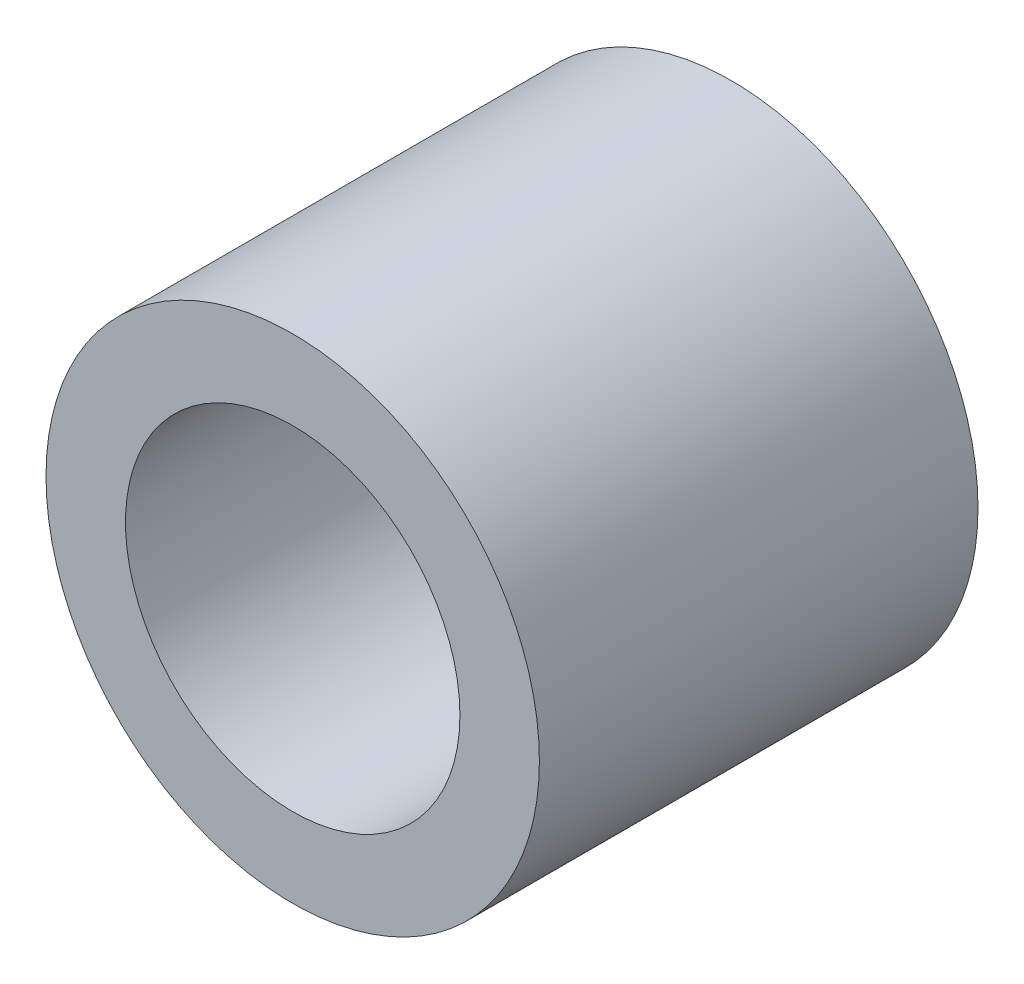
ISO-10303-21;
HEADER;
FILE_DESCRIPTION(('STEP AP214'),'2;1');
FILE_NAME('part.step','',(''),(''),'','','');
FILE_SCHEMA(('AUTOMOTIVE_DESIGN { 1 0 10303 214 1 1 1 1 }'));
ENDSEC;
DATA;
#1=APPLICATION_CONTEXT('core data for automotive mechanical design processes');
#2=APPLICATION_PROTOCOL_DEFINITION('international standard','automotive_design',2000,#1);
#3=PRODUCT_CONTEXT('',#1,'mechanical');
#4=PRODUCT('Part','Part','',(#3));
#5=PRODUCT_RELATED_PRODUCT_CATEGORY('part','',(#4));
#6=PRODUCT_DEFINITION_FORMATION('','',#4);
#7=PRODUCT_DEFINITION_CONTEXT('part definition',#1,'design');
#8=PRODUCT_DEFINITION('design','',#6,#7);
#9=PRODUCT_DEFINITION_SHAPE('','',#8);
#10=(LENGTH_UNIT() NAMED_UNIT(*) SI_UNIT(.MILLI.,.METRE.));
#11=(NAMED_UNIT(*) PLANE_ANGLE_UNIT() SI_UNIT($,.RADIAN.));
#12=(NAMED_UNIT(*) SI_UNIT($,.STERADIAN.) SOLID_ANGLE_UNIT());
#13=UNCERTAINTY_MEASURE_WITH_UNIT(LENGTH_MEASURE(1.E-05),#10,'distance_accuracy_value','');
#14=(GEOMETRIC_REPRESENTATION_CONTEXT(3) GLOBAL_UNCERTAINTY_ASSIGNED_CONTEXT((#13)) GLOBAL_UNIT_ASSIGNED_CONTEXT((#10,
#11,#12)) REPRESENTATION_CONTEXT('',''));
#15=CARTESIAN_POINT('',(0.,0.,0.));
#16=DIRECTION('',(0.,0.,1.));
#17=DIRECTION('',(1.,0.,0.));
#18=AXIS2_PLACEMENT_3D('',#15,#16,#17);
#19=CARTESIAN_POINT('',(0.,0.,1.5));
#20=DIRECTION('',(0.,0.,-1.));
#21=DIRECTION('',(-1.,0.,0.));
#22=AXIS2_PLACEMENT_3D('',#19,#20,#21);
#23=CYLINDRICAL_SURFACE('',#22,2.25);
#24=CARTESIAN_POINT('',(0.,0.,0.));
#25=DIRECTION('',(0.,0.,1.));
#26=DIRECTION('',(1.,0.,0.));
#27=AXIS2_PLACEMENT_3D('',#24,#25,#26);
#28=CIRCLE('',#27,2.25);
#29=CARTESIAN_POINT('',(2.25,0.,0.));
#30=VERTEX_POINT('',#29);
#31=EDGE_CURVE('E10',#30,#30,#28,.T.);
#32=ORIENTED_EDGE('',*,*,#31,.T.);
#33=EDGE_LOOP('',(#32));
#34=FACE_BOUND('',#33,.T.);
#35=CARTESIAN_POINT('',(0.,0.,4.));
#36=DIRECTION('',(0.,0.,1.));
#37=DIRECTION('',(1.,0.,0.));
#38=AXIS2_PLACEMENT_3D('',#35,#36,#37);
#39=CIRCLE('',#38,2.25);
#40=CARTESIAN_POINT('',(2.25,0.,4.));
#41=VERTEX_POINT('',#40);
#42=EDGE_CURVE('E38',#41,#41,#39,.T.);
#43=ORIENTED_EDGE('',*,*,#42,.F.);
#44=EDGE_LOOP('',(#43));
#45=FACE_BOUND('',#44,.T.);
#46=ADVANCED_FACE('F32',(#34,#45),#23,.T.);
#47=CARTESIAN_POINT('',(0.,0.,0.));
#48=DIRECTION('',(0.,0.,1.));
#49=DIRECTION('',(1.,0.,0.));
#50=AXIS2_PLACEMENT_3D('',#47,#48,#49);
#51=PLANE('',#50);
#52=ORIENTED_EDGE('',*,*,#31,.F.);
#53=EDGE_LOOP('',(#52));
#54=FACE_BOUND('',#53,.T.);
#55=ADVANCED_FACE('F64',(#54),#51,.F.);
#56=CARTESIAN_POINT('',(0.,0.,4.));
#57=DIRECTION('',(0.,0.,1.));
#58=DIRECTION('',(1.,0.,0.));
#59=AXIS2_PLACEMENT_3D('',#56,#57,#58);
#60=PLANE('',#59);
#61=CARTESIAN_POINT('',(0.,0.,4.));
#62=DIRECTION('',(0.,0.,1.));
#63=DIRECTION('',(1.,0.,0.));
#64=AXIS2_PLACEMENT_3D('',#61,#62,#63);
#65=CIRCLE('',#64,1.525);
#66=CARTESIAN_POINT('',(1.525,0.,4.));
#67=VERTEX_POINT('',#66);
#68=EDGE_CURVE('E42',#67,#67,#65,.T.);
#69=ORIENTED_EDGE('',*,*,#68,.F.);
#70=EDGE_LOOP('',(#69));
#71=FACE_BOUND('',#70,.T.);
#72=ORIENTED_EDGE('',*,*,#42,.T.);
#73=EDGE_LOOP('',(#72));
#74=FACE_BOUND('',#73,.T.);
#75=ADVANCED_FACE('F56',(#71,#74),#60,.T.);
#76=CARTESIAN_POINT('',(0.,0.,4.));
#77=DIRECTION('',(0.,0.,-1.));
#78=DIRECTION('',(-1.,0.,0.));
#79=AXIS2_PLACEMENT_3D('',#76,#77,#78);
#80=CYLINDRICAL_SURFACE('',#79,1.525);
#81=ORIENTED_EDGE('',*,*,#68,.T.);
#82=EDGE_LOOP('',(#81));
#83=FACE_BOUND('',#82,.T.);
#84=CARTESIAN_POINT('',(0.,0.,1.5));
#85=DIRECTION('',(0.,0.,1.));
#86=DIRECTION('',(1.,0.,0.));
#87=AXIS2_PLACEMENT_3D('',#84,#85,#86);
#88=CIRCLE('',#87,1.525);
#89=CARTESIAN_POINT('',(1.525,0.,1.5));
#90=VERTEX_POINT('',#89);
#91=EDGE_CURVE('E46',#90,#90,#88,.T.);
#92=ORIENTED_EDGE('',*,*,#91,.F.);
#93=EDGE_LOOP('',(#92));
#94=FACE_BOUND('',#93,.T.);
#95=ADVANCED_FACE('F54',(#83,#94),#80,.F.);
#96=CARTESIAN_POINT('',(0.,0.,1.5));
#97=DIRECTION('',(0.,0.,1.));
#98=DIRECTION('',(1.,0.,0.));
#99=AXIS2_PLACEMENT_3D('',#96,#97,#98);
#100=PLANE('',#99);
#101=ORIENTED_EDGE('',*,*,#91,.T.);
#102=EDGE_LOOP('',(#101));
#103=FACE_BOUND('',#102,.T.);
#104=ADVANCED_FACE('F52',(#103),#100,.T.);
#105=CLOSED_SHELL('',(#46,#55,#75,#95,#104));
#106=MANIFOLD_SOLID_BREP('B2',#105);
#107=ADVANCED_BREP_SHAPE_REPRESENTATION('',(#18,#106),#14);
#108=SHAPE_DEFINITION_REPRESENTATION(#9,#107);
ENDSEC;
END-ISO-10303-21;
